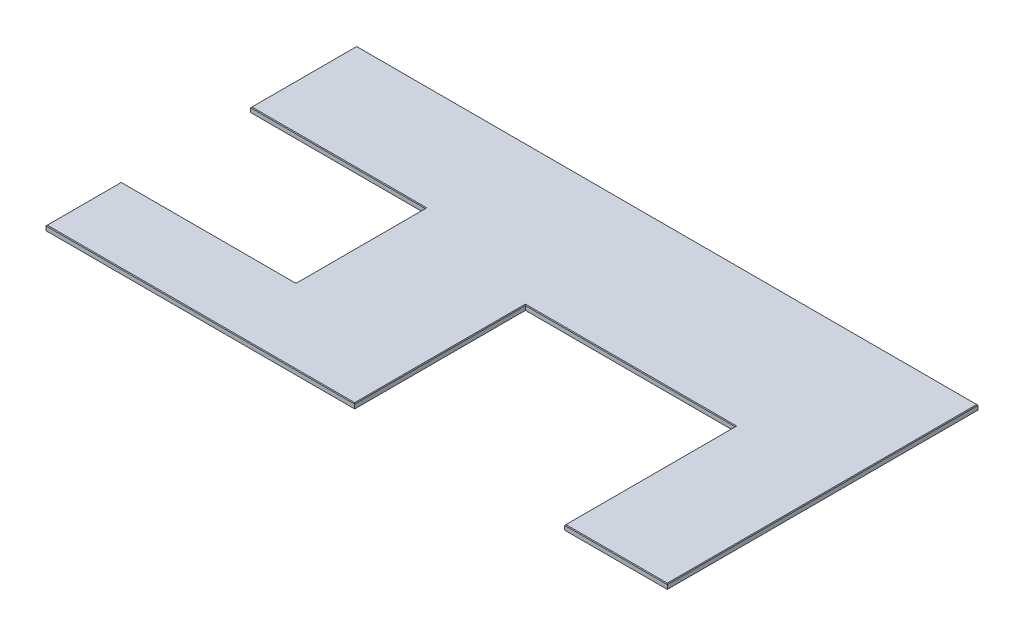
ISO-10303-21;
HEADER;
FILE_DESCRIPTION(('STEP AP214'),'2;1');
FILE_NAME('part.step','',(''),(''),'','','');
FILE_SCHEMA(('AUTOMOTIVE_DESIGN { 1 0 10303 214 1 1 1 1 }'));
ENDSEC;
DATA;
#1=APPLICATION_CONTEXT('core data for automotive mechanical design processes');
#2=APPLICATION_PROTOCOL_DEFINITION('international standard','automotive_design',2000,#1);
#3=PRODUCT_CONTEXT('',#1,'mechanical');
#4=PRODUCT('Part','Part','',(#3));
#5=PRODUCT_RELATED_PRODUCT_CATEGORY('part','',(#4));
#6=PRODUCT_DEFINITION_FORMATION('','',#4);
#7=PRODUCT_DEFINITION_CONTEXT('part definition',#1,'design');
#8=PRODUCT_DEFINITION('design','',#6,#7);
#9=PRODUCT_DEFINITION_SHAPE('','',#8);
#10=(LENGTH_UNIT() NAMED_UNIT(*) SI_UNIT(.MILLI.,.METRE.));
#11=(NAMED_UNIT(*) PLANE_ANGLE_UNIT() SI_UNIT($,.RADIAN.));
#12=(NAMED_UNIT(*) SI_UNIT($,.STERADIAN.) SOLID_ANGLE_UNIT());
#13=UNCERTAINTY_MEASURE_WITH_UNIT(LENGTH_MEASURE(1.E-05),#10,'distance_accuracy_value','');
#14=(GEOMETRIC_REPRESENTATION_CONTEXT(3) GLOBAL_UNCERTAINTY_ASSIGNED_CONTEXT((#13)) GLOBAL_UNIT_ASSIGNED_CONTEXT((#10,
#11,#12)) REPRESENTATION_CONTEXT('',''));
#15=CARTESIAN_POINT('',(0.,0.,0.));
#16=DIRECTION('',(0.,0.,1.));
#17=DIRECTION('',(1.,0.,0.));
#18=AXIS2_PLACEMENT_3D('',#15,#16,#17);
#19=CARTESIAN_POINT('',(0.,-19.05,0.));
#20=DIRECTION('',(0.,0.,1.));
#21=DIRECTION('',(1.,0.,0.));
#22=AXIS2_PLACEMENT_3D('',#19,#20,#21);
#23=PLANE('',#22);
#24=DIRECTION('',(0.,1.,0.));
#25=VECTOR('',#24,1.);
#26=CARTESIAN_POINT('',(1211.5165,-19.05,0.));
#27=LINE('',#26,#25);
#28=CARTESIAN_POINT('',(1211.5165,-19.05,0.));
#29=VERTEX_POINT('',#28);
#30=CARTESIAN_POINT('',(1211.5165,-2.53999999999999,0.));
#31=VERTEX_POINT('',#30);
#32=EDGE_CURVE('E165',#29,#31,#27,.T.);
#33=ORIENTED_EDGE('',*,*,#32,.T.);
#34=DIRECTION('',(-1.,0.,0.));
#35=VECTOR('',#34,1.);
#36=CARTESIAN_POINT('',(0.,-2.53999999999999,0.));
#37=LINE('',#36,#35);
#38=CARTESIAN_POINT('',(0.,-2.53999999999999,0.));
#39=VERTEX_POINT('',#38);
#40=EDGE_CURVE('E11',#31,#39,#37,.T.);
#41=ORIENTED_EDGE('',*,*,#40,.T.);
#42=DIRECTION('',(0.,1.,0.));
#43=VECTOR('',#42,1.);
#44=CARTESIAN_POINT('',(0.,-19.05,0.));
#45=LINE('',#44,#43);
#46=CARTESIAN_POINT('',(0.,-19.05,0.));
#47=VERTEX_POINT('',#46);
#48=EDGE_CURVE('E187',#47,#39,#45,.T.);
#49=ORIENTED_EDGE('',*,*,#48,.F.);
#50=DIRECTION('',(1.,0.,0.));
#51=VECTOR('',#50,1.);
#52=CARTESIAN_POINT('',(0.,-19.05,0.));
#53=LINE('',#52,#51);
#54=EDGE_CURVE('E180',#47,#29,#53,.T.);
#55=ORIENTED_EDGE('',*,*,#54,.T.);
#56=EDGE_LOOP('',(#33,#41,#49,#55));
#57=FACE_BOUND('',#56,.T.);
#58=ADVANCED_FACE('F40',(#57),#23,.T.);
#59=CARTESIAN_POINT('',(1.13148179390222E-13,-19.05,-295.275));
#60=DIRECTION('',(-1.,0.,0.));
#61=DIRECTION('',(0.,0.,1.));
#62=AXIS2_PLACEMENT_3D('',#59,#60,#61);
#63=PLANE('',#62);
#64=ORIENTED_EDGE('',*,*,#48,.T.);
#65=DIRECTION('',(0.,0.,-1.));
#66=VECTOR('',#65,1.);
#67=CARTESIAN_POINT('',(1.13148179390222E-13,-2.53999999999999,-295.275));
#68=LINE('',#67,#66);
#69=CARTESIAN_POINT('',(1.13148179390222E-13,-2.53999999999999,-295.275));
#70=VERTEX_POINT('',#69);
#71=EDGE_CURVE('E271',#39,#70,#68,.T.);
#72=ORIENTED_EDGE('',*,*,#71,.T.);
#73=DIRECTION('',(0.,1.,0.));
#74=VECTOR('',#73,1.);
#75=CARTESIAN_POINT('',(1.13148179390222E-13,-19.05,-295.275));
#76=LINE('',#75,#74);
#77=CARTESIAN_POINT('',(1.13148179390222E-13,-19.05,-295.275));
#78=VERTEX_POINT('',#77);
#79=EDGE_CURVE('E220',#78,#70,#76,.T.);
#80=ORIENTED_EDGE('',*,*,#79,.F.);
#81=DIRECTION('',(0.,0.,1.));
#82=VECTOR('',#81,1.);
#83=CARTESIAN_POINT('',(1.13148179390222E-13,-19.05,-295.275));
#84=LINE('',#83,#82);
#85=EDGE_CURVE('E173',#78,#47,#84,.T.);
#86=ORIENTED_EDGE('',*,*,#85,.T.);
#87=EDGE_LOOP('',(#64,#72,#80,#86));
#88=FACE_BOUND('',#87,.T.);
#89=ADVANCED_FACE('F353',(#88),#63,.T.);
#90=CARTESIAN_POINT('',(1.13148179390222E-13,-19.05,-295.275));
#91=DIRECTION('',(0.,0.,-1.));
#92=DIRECTION('',(-1.,0.,0.));
#93=AXIS2_PLACEMENT_3D('',#90,#91,#92);
#94=PLANE('',#93);
#95=ORIENTED_EDGE('',*,*,#79,.T.);
#96=DIRECTION('',(1.,0.,0.));
#97=VECTOR('',#96,1.);
#98=CARTESIAN_POINT('',(1.13148179390222E-13,-2.53999999999999,-295.275));
#99=LINE('',#98,#97);
#100=CARTESIAN_POINT('',(685.8,-2.53999999999999,-295.275));
#101=VERTEX_POINT('',#100);
#102=EDGE_CURVE('E274',#70,#101,#99,.T.);
#103=ORIENTED_EDGE('',*,*,#102,.T.);
#104=DIRECTION('',(0.,1.,0.));
#105=VECTOR('',#104,1.);
#106=CARTESIAN_POINT('',(685.8,-19.05,-295.275));
#107=LINE('',#106,#105);
#108=CARTESIAN_POINT('',(685.8,-19.05,-295.275));
#109=VERTEX_POINT('',#108);
#110=EDGE_CURVE('E223',#109,#101,#107,.T.);
#111=ORIENTED_EDGE('',*,*,#110,.F.);
#112=DIRECTION('',(-1.,0.,0.));
#113=VECTOR('',#112,1.);
#114=CARTESIAN_POINT('',(1.13148179390222E-13,-19.05,-295.275));
#115=LINE('',#114,#113);
#116=EDGE_CURVE('E214',#109,#78,#115,.T.);
#117=ORIENTED_EDGE('',*,*,#116,.T.);
#118=EDGE_LOOP('',(#95,#103,#111,#117));
#119=FACE_BOUND('',#118,.T.);
#120=ADVANCED_FACE('F364',(#119),#94,.T.);
#121=CARTESIAN_POINT('',(685.8,-19.05,-803.275));
#122=DIRECTION('',(-1.,0.,0.));
#123=DIRECTION('',(0.,0.,1.));
#124=AXIS2_PLACEMENT_3D('',#121,#122,#123);
#125=PLANE('',#124);
#126=ORIENTED_EDGE('',*,*,#110,.T.);
#127=DIRECTION('',(0.,0.,-1.));
#128=VECTOR('',#127,1.);
#129=CARTESIAN_POINT('',(685.8,-2.53999999999999,-803.275));
#130=LINE('',#129,#128);
#131=CARTESIAN_POINT('',(685.8,-2.53999999999999,-803.275));
#132=VERTEX_POINT('',#131);
#133=EDGE_CURVE('E276',#101,#132,#130,.T.);
#134=ORIENTED_EDGE('',*,*,#133,.T.);
#135=DIRECTION('',(0.,1.,0.));
#136=VECTOR('',#135,1.);
#137=CARTESIAN_POINT('',(685.8,-19.05,-803.275));
#138=LINE('',#137,#136);
#139=CARTESIAN_POINT('',(685.8,-19.05,-803.275));
#140=VERTEX_POINT('',#139);
#141=EDGE_CURVE('E226',#140,#132,#138,.T.);
#142=ORIENTED_EDGE('',*,*,#141,.F.);
#143=DIRECTION('',(0.,0.,1.));
#144=VECTOR('',#143,1.);
#145=CARTESIAN_POINT('',(685.8,-19.05,-803.275));
#146=LINE('',#145,#144);
#147=EDGE_CURVE('E211',#140,#109,#146,.T.);
#148=ORIENTED_EDGE('',*,*,#147,.T.);
#149=EDGE_LOOP('',(#126,#134,#142,#148));
#150=FACE_BOUND('',#149,.T.);
#151=ADVANCED_FACE('F368',(#150),#125,.T.);
#152=CARTESIAN_POINT('',(0.,-19.05,-803.275));
#153=DIRECTION('',(0.,0.,1.));
#154=DIRECTION('',(1.,0.,0.));
#155=AXIS2_PLACEMENT_3D('',#152,#153,#154);
#156=PLANE('',#155);
#157=ORIENTED_EDGE('',*,*,#141,.T.);
#158=DIRECTION('',(-1.,0.,0.));
#159=VECTOR('',#158,1.);
#160=CARTESIAN_POINT('',(0.,-2.53999999999999,-803.275));
#161=LINE('',#160,#159);
#162=CARTESIAN_POINT('',(0.,-2.53999999999999,-803.275));
#163=VERTEX_POINT('',#162);
#164=EDGE_CURVE('E278',#132,#163,#161,.T.);
#165=ORIENTED_EDGE('',*,*,#164,.T.);
#166=DIRECTION('',(0.,1.,0.));
#167=VECTOR('',#166,1.);
#168=CARTESIAN_POINT('',(0.,-19.05,-803.275));
#169=LINE('',#168,#167);
#170=CARTESIAN_POINT('',(0.,-19.05,-803.275));
#171=VERTEX_POINT('',#170);
#172=EDGE_CURVE('E229',#171,#163,#169,.T.);
#173=ORIENTED_EDGE('',*,*,#172,.F.);
#174=DIRECTION('',(1.,0.,0.));
#175=VECTOR('',#174,1.);
#176=CARTESIAN_POINT('',(0.,-19.05,-803.275));
#177=LINE('',#176,#175);
#178=EDGE_CURVE('E208',#171,#140,#177,.T.);
#179=ORIENTED_EDGE('',*,*,#178,.T.);
#180=EDGE_LOOP('',(#157,#165,#173,#179));
#181=FACE_BOUND('',#180,.T.);
#182=ADVANCED_FACE('F380',(#181),#156,.T.);
#183=CARTESIAN_POINT('',(-2.29534139493609E-13,-19.05,-1219.2));
#184=DIRECTION('',(-1.,0.,0.));
#185=DIRECTION('',(0.,0.,1.));
#186=AXIS2_PLACEMENT_3D('',#183,#184,#185);
#187=PLANE('',#186);
#188=ORIENTED_EDGE('',*,*,#172,.T.);
#189=DIRECTION('',(0.,0.,-1.));
#190=VECTOR('',#189,1.);
#191=CARTESIAN_POINT('',(-2.29534139493609E-13,-2.53999999999999,-1219.2));
#192=LINE('',#191,#190);
#193=CARTESIAN_POINT('',(-2.29534139493609E-13,-2.53999999999999,-1219.2));
#194=VERTEX_POINT('',#193);
#195=EDGE_CURVE('E280',#163,#194,#192,.T.);
#196=ORIENTED_EDGE('',*,*,#195,.T.);
#197=DIRECTION('',(0.,1.,0.));
#198=VECTOR('',#197,1.);
#199=CARTESIAN_POINT('',(-2.29534139493609E-13,-19.05,-1219.2));
#200=LINE('',#199,#198);
#201=CARTESIAN_POINT('',(-2.29534139493609E-13,-19.05,-1219.2));
#202=VERTEX_POINT('',#201);
#203=EDGE_CURVE('E232',#202,#194,#200,.T.);
#204=ORIENTED_EDGE('',*,*,#203,.F.);
#205=DIRECTION('',(0.,0.,1.));
#206=VECTOR('',#205,1.);
#207=CARTESIAN_POINT('',(-2.29534139493609E-13,-19.05,-1219.2));
#208=LINE('',#207,#206);
#209=EDGE_CURVE('E205',#202,#171,#208,.T.);
#210=ORIENTED_EDGE('',*,*,#209,.T.);
#211=EDGE_LOOP('',(#188,#196,#204,#210));
#212=FACE_BOUND('',#211,.T.);
#213=ADVANCED_FACE('F384',(#212),#187,.T.);
#214=CARTESIAN_POINT('',(2438.4,-19.05,-1219.2));
#215=DIRECTION('',(0.,0.,-1.));
#216=DIRECTION('',(-1.,0.,0.));
#217=AXIS2_PLACEMENT_3D('',#214,#215,#216);
#218=PLANE('',#217);
#219=ORIENTED_EDGE('',*,*,#203,.T.);
#220=DIRECTION('',(1.,0.,0.));
#221=VECTOR('',#220,1.);
#222=CARTESIAN_POINT('',(2438.4,-2.53999999999999,-1219.2));
#223=LINE('',#222,#221);
#224=CARTESIAN_POINT('',(2438.4,-2.53999999999999,-1219.2));
#225=VERTEX_POINT('',#224);
#226=EDGE_CURVE('E282',#194,#225,#223,.T.);
#227=ORIENTED_EDGE('',*,*,#226,.T.);
#228=DIRECTION('',(0.,1.,0.));
#229=VECTOR('',#228,1.);
#230=CARTESIAN_POINT('',(2438.4,-19.05,-1219.2));
#231=LINE('',#230,#229);
#232=CARTESIAN_POINT('',(2438.4,-19.05,-1219.2));
#233=VERTEX_POINT('',#232);
#234=EDGE_CURVE('E235',#233,#225,#231,.T.);
#235=ORIENTED_EDGE('',*,*,#234,.F.);
#236=DIRECTION('',(-1.,0.,0.));
#237=VECTOR('',#236,1.);
#238=CARTESIAN_POINT('',(2438.4,-19.05,-1219.2));
#239=LINE('',#238,#237);
#240=EDGE_CURVE('E202',#233,#202,#239,.T.);
#241=ORIENTED_EDGE('',*,*,#240,.T.);
#242=EDGE_LOOP('',(#219,#227,#235,#241));
#243=FACE_BOUND('',#242,.T.);
#244=ADVANCED_FACE('F393',(#243),#218,.T.);
#245=CARTESIAN_POINT('',(2438.4,-19.05,0.));
#246=DIRECTION('',(1.,0.,0.));
#247=DIRECTION('',(0.,0.,-1.));
#248=AXIS2_PLACEMENT_3D('',#245,#246,#247);
#249=PLANE('',#248);
#250=ORIENTED_EDGE('',*,*,#234,.T.);
#251=DIRECTION('',(0.,0.,1.));
#252=VECTOR('',#251,1.);
#253=CARTESIAN_POINT('',(2438.4,-2.53999999999999,0.));
#254=LINE('',#253,#252);
#255=CARTESIAN_POINT('',(2438.4,-2.53999999999999,0.));
#256=VERTEX_POINT('',#255);
#257=EDGE_CURVE('E284',#225,#256,#254,.T.);
#258=ORIENTED_EDGE('',*,*,#257,.T.);
#259=DIRECTION('',(0.,1.,0.));
#260=VECTOR('',#259,1.);
#261=CARTESIAN_POINT('',(2438.4,-19.05,0.));
#262=LINE('',#261,#260);
#263=CARTESIAN_POINT('',(2438.4,-19.05,0.));
#264=VERTEX_POINT('',#263);
#265=EDGE_CURVE('E238',#264,#256,#262,.T.);
#266=ORIENTED_EDGE('',*,*,#265,.F.);
#267=DIRECTION('',(0.,0.,-1.));
#268=VECTOR('',#267,1.);
#269=CARTESIAN_POINT('',(2438.4,-19.05,0.));
#270=LINE('',#269,#268);
#271=EDGE_CURVE('E199',#264,#233,#270,.T.);
#272=ORIENTED_EDGE('',*,*,#271,.T.);
#273=EDGE_LOOP('',(#250,#258,#266,#272));
#274=FACE_BOUND('',#273,.T.);
#275=ADVANCED_FACE('F396',(#274),#249,.T.);
#276=CARTESIAN_POINT('',(2035.429,-19.05,0.));
#277=DIRECTION('',(0.,0.,1.));
#278=DIRECTION('',(1.,0.,0.));
#279=AXIS2_PLACEMENT_3D('',#276,#277,#278);
#280=PLANE('',#279);
#281=ORIENTED_EDGE('',*,*,#265,.T.);
#282=DIRECTION('',(-1.,0.,0.));
#283=VECTOR('',#282,1.);
#284=CARTESIAN_POINT('',(2035.429,-2.53999999999999,0.));
#285=LINE('',#284,#283);
#286=CARTESIAN_POINT('',(2035.429,-2.53999999999999,0.));
#287=VERTEX_POINT('',#286);
#288=EDGE_CURVE('E286',#256,#287,#285,.T.);
#289=ORIENTED_EDGE('',*,*,#288,.T.);
#290=DIRECTION('',(0.,1.,0.));
#291=VECTOR('',#290,1.);
#292=CARTESIAN_POINT('',(2035.429,-19.05,0.));
#293=LINE('',#292,#291);
#294=CARTESIAN_POINT('',(2035.429,-19.05,0.));
#295=VERTEX_POINT('',#294);
#296=EDGE_CURVE('E241',#295,#287,#293,.T.);
#297=ORIENTED_EDGE('',*,*,#296,.F.);
#298=DIRECTION('',(1.,0.,0.));
#299=VECTOR('',#298,1.);
#300=CARTESIAN_POINT('',(2035.429,-19.05,0.));
#301=LINE('',#300,#299);
#302=EDGE_CURVE('E196',#295,#264,#301,.T.);
#303=ORIENTED_EDGE('',*,*,#302,.T.);
#304=EDGE_LOOP('',(#281,#289,#297,#303));
#305=FACE_BOUND('',#304,.T.);
#306=ADVANCED_FACE('F400',(#305),#280,.T.);
#307=CARTESIAN_POINT('',(2035.429,-19.05,-669.925));
#308=DIRECTION('',(-1.,0.,0.));
#309=DIRECTION('',(0.,0.,1.));
#310=AXIS2_PLACEMENT_3D('',#307,#308,#309);
#311=PLANE('',#310);
#312=ORIENTED_EDGE('',*,*,#296,.T.);
#313=DIRECTION('',(0.,0.,-1.));
#314=VECTOR('',#313,1.);
#315=CARTESIAN_POINT('',(2035.429,-2.53999999999999,-669.925));
#316=LINE('',#315,#314);
#317=CARTESIAN_POINT('',(2035.429,-2.53999999999999,-669.925));
#318=VERTEX_POINT('',#317);
#319=EDGE_CURVE('E288',#287,#318,#316,.T.);
#320=ORIENTED_EDGE('',*,*,#319,.T.);
#321=DIRECTION('',(0.,1.,0.));
#322=VECTOR('',#321,1.);
#323=CARTESIAN_POINT('',(2035.429,-19.05,-669.925));
#324=LINE('',#323,#322);
#325=CARTESIAN_POINT('',(2035.429,-19.05,-669.925));
#326=VERTEX_POINT('',#325);
#327=EDGE_CURVE('E244',#326,#318,#324,.T.);
#328=ORIENTED_EDGE('',*,*,#327,.F.);
#329=DIRECTION('',(0.,0.,1.));
#330=VECTOR('',#329,1.);
#331=CARTESIAN_POINT('',(2035.429,-19.05,-669.925));
#332=LINE('',#331,#330);
#333=EDGE_CURVE('E193',#326,#295,#332,.T.);
#334=ORIENTED_EDGE('',*,*,#333,.T.);
#335=EDGE_LOOP('',(#312,#320,#328,#334));
#336=FACE_BOUND('',#335,.T.);
#337=ADVANCED_FACE('F402',(#336),#311,.T.);
#338=CARTESIAN_POINT('',(1211.5165,-19.05,-669.925));
#339=DIRECTION('',(0.,0.,1.));
#340=DIRECTION('',(1.,0.,0.));
#341=AXIS2_PLACEMENT_3D('',#338,#339,#340);
#342=PLANE('',#341);
#343=ORIENTED_EDGE('',*,*,#327,.T.);
#344=DIRECTION('',(-1.,0.,0.));
#345=VECTOR('',#344,1.);
#346=CARTESIAN_POINT('',(1211.5165,-2.53999999999999,-669.925));
#347=LINE('',#346,#345);
#348=CARTESIAN_POINT('',(1211.5165,-2.53999999999999,-669.925));
#349=VERTEX_POINT('',#348);
#350=EDGE_CURVE('E65',#318,#349,#347,.T.);
#351=ORIENTED_EDGE('',*,*,#350,.T.);
#352=DIRECTION('',(0.,1.,0.));
#353=VECTOR('',#352,1.);
#354=CARTESIAN_POINT('',(1211.5165,-19.05,-669.925));
#355=LINE('',#354,#353);
#356=CARTESIAN_POINT('',(1211.5165,-19.05,-669.925));
#357=VERTEX_POINT('',#356);
#358=EDGE_CURVE('E172',#357,#349,#355,.T.);
#359=ORIENTED_EDGE('',*,*,#358,.F.);
#360=DIRECTION('',(1.,0.,0.));
#361=VECTOR('',#360,1.);
#362=CARTESIAN_POINT('',(1211.5165,-19.05,-669.925));
#363=LINE('',#362,#361);
#364=EDGE_CURVE('E184',#357,#326,#363,.T.);
#365=ORIENTED_EDGE('',*,*,#364,.T.);
#366=EDGE_LOOP('',(#343,#351,#359,#365));
#367=FACE_BOUND('',#366,.T.);
#368=ADVANCED_FACE('F403',(#367),#342,.T.);
#369=CARTESIAN_POINT('',(1211.5165,-19.05,0.));
#370=DIRECTION('',(1.,0.,0.));
#371=DIRECTION('',(0.,0.,-1.));
#372=AXIS2_PLACEMENT_3D('',#369,#370,#371);
#373=PLANE('',#372);
#374=ORIENTED_EDGE('',*,*,#358,.T.);
#375=DIRECTION('',(0.,0.,1.));
#376=VECTOR('',#375,1.);
#377=CARTESIAN_POINT('',(1211.5165,-2.53999999999999,0.));
#378=LINE('',#377,#376);
#379=EDGE_CURVE('E50',#349,#31,#378,.T.);
#380=ORIENTED_EDGE('',*,*,#379,.T.);
#381=ORIENTED_EDGE('',*,*,#32,.F.);
#382=DIRECTION('',(0.,0.,-1.));
#383=VECTOR('',#382,1.);
#384=CARTESIAN_POINT('',(1211.5165,-19.05,0.));
#385=LINE('',#384,#383);
#386=EDGE_CURVE('E168',#29,#357,#385,.T.);
#387=ORIENTED_EDGE('',*,*,#386,.T.);
#388=EDGE_LOOP('',(#374,#380,#381,#387));
#389=FACE_BOUND('',#388,.T.);
#390=ADVANCED_FACE('F167',(#389),#373,.T.);
#391=CARTESIAN_POINT('',(0.,-19.05,0.));
#392=DIRECTION('',(0.,1.,0.));
#393=DIRECTION('',(0.,0.,1.));
#394=AXIS2_PLACEMENT_3D('',#391,#392,#393);
#395=PLANE('',#394);
#396=ORIENTED_EDGE('',*,*,#54,.F.);
#397=ORIENTED_EDGE('',*,*,#85,.F.);
#398=ORIENTED_EDGE('',*,*,#116,.F.);
#399=ORIENTED_EDGE('',*,*,#147,.F.);
#400=ORIENTED_EDGE('',*,*,#178,.F.);
#401=ORIENTED_EDGE('',*,*,#209,.F.);
#402=ORIENTED_EDGE('',*,*,#240,.F.);
#403=ORIENTED_EDGE('',*,*,#271,.F.);
#404=ORIENTED_EDGE('',*,*,#302,.F.);
#405=ORIENTED_EDGE('',*,*,#333,.F.);
#406=ORIENTED_EDGE('',*,*,#364,.F.);
#407=ORIENTED_EDGE('',*,*,#386,.F.);
#408=EDGE_LOOP('',(#396,#397,#398,#399,#400,#401,#402,#403,#404,#405,#406,#407));
#409=FACE_BOUND('',#408,.T.);
#410=ADVANCED_FACE('F178',(#409),#395,.F.);
#411=CARTESIAN_POINT('',(0.,0.,0.));
#412=DIRECTION('',(0.,1.,0.));
#413=DIRECTION('',(0.,0.,1.));
#414=AXIS2_PLACEMENT_3D('',#411,#412,#413);
#415=PLANE('',#414);
#416=DIRECTION('',(-1.,0.,0.));
#417=VECTOR('',#416,1.);
#418=CARTESIAN_POINT('',(0.,0.,-292.735));
#419=LINE('',#418,#417);
#420=CARTESIAN_POINT('',(688.34,0.,-292.735));
#421=VERTEX_POINT('',#420);
#422=CARTESIAN_POINT('',(2.5400000000001,0.,-292.735));
#423=VERTEX_POINT('',#422);
#424=EDGE_CURVE('E266',#421,#423,#419,.T.);
#425=ORIENTED_EDGE('',*,*,#424,.T.);
#426=DIRECTION('',(0.,0.,1.));
#427=VECTOR('',#426,1.);
#428=CARTESIAN_POINT('',(2.53999999999999,0.,0.));
#429=LINE('',#428,#427);
#430=CARTESIAN_POINT('',(2.53999999999999,0.,-2.53999999999999));
#431=VERTEX_POINT('',#430);
#432=EDGE_CURVE('E268',#423,#431,#429,.T.);
#433=ORIENTED_EDGE('',*,*,#432,.T.);
#434=DIRECTION('',(1.,0.,0.));
#435=VECTOR('',#434,1.);
#436=CARTESIAN_POINT('',(0.,0.,-2.53999999999999));
#437=LINE('',#436,#435);
#438=CARTESIAN_POINT('',(1208.9765,0.,-2.53999999999999));
#439=VERTEX_POINT('',#438);
#440=EDGE_CURVE('E219',#431,#439,#437,.T.);
#441=ORIENTED_EDGE('',*,*,#440,.T.);
#442=DIRECTION('',(0.,0.,-1.));
#443=VECTOR('',#442,1.);
#444=CARTESIAN_POINT('',(1208.9765,0.,0.));
#445=LINE('',#444,#443);
#446=CARTESIAN_POINT('',(1208.9765,0.,-672.465));
#447=VERTEX_POINT('',#446);
#448=EDGE_CURVE('E248',#439,#447,#445,.T.);
#449=ORIENTED_EDGE('',*,*,#448,.T.);
#450=DIRECTION('',(1.,0.,0.));
#451=VECTOR('',#450,1.);
#452=CARTESIAN_POINT('',(0.,0.,-672.465));
#453=LINE('',#452,#451);
#454=CARTESIAN_POINT('',(2037.969,0.,-672.465));
#455=VERTEX_POINT('',#454);
#456=EDGE_CURVE('E250',#447,#455,#453,.T.);
#457=ORIENTED_EDGE('',*,*,#456,.T.);
#458=DIRECTION('',(0.,0.,1.));
#459=VECTOR('',#458,1.);
#460=CARTESIAN_POINT('',(2037.969,0.,0.));
#461=LINE('',#460,#459);
#462=CARTESIAN_POINT('',(2037.969,0.,-2.53999999999999));
#463=VERTEX_POINT('',#462);
#464=EDGE_CURVE('E252',#455,#463,#461,.T.);
#465=ORIENTED_EDGE('',*,*,#464,.T.);
#466=DIRECTION('',(1.,0.,0.));
#467=VECTOR('',#466,1.);
#468=CARTESIAN_POINT('',(0.,0.,-2.53999999999999));
#469=LINE('',#468,#467);
#470=CARTESIAN_POINT('',(2435.86,0.,-2.53999999999999));
#471=VERTEX_POINT('',#470);
#472=EDGE_CURVE('E254',#463,#471,#469,.T.);
#473=ORIENTED_EDGE('',*,*,#472,.T.);
#474=DIRECTION('',(0.,0.,-1.));
#475=VECTOR('',#474,1.);
#476=CARTESIAN_POINT('',(2435.86,0.,0.));
#477=LINE('',#476,#475);
#478=CARTESIAN_POINT('',(2435.86,0.,-1216.66));
#479=VERTEX_POINT('',#478);
#480=EDGE_CURVE('E256',#471,#479,#477,.T.);
#481=ORIENTED_EDGE('',*,*,#480,.T.);
#482=DIRECTION('',(-1.,0.,0.));
#483=VECTOR('',#482,1.);
#484=CARTESIAN_POINT('',(0.,0.,-1216.66));
#485=LINE('',#484,#483);
#486=CARTESIAN_POINT('',(2.53999999999976,0.,-1216.66));
#487=VERTEX_POINT('',#486);
#488=EDGE_CURVE('E258',#479,#487,#485,.T.);
#489=ORIENTED_EDGE('',*,*,#488,.T.);
#490=DIRECTION('',(0.,0.,1.));
#491=VECTOR('',#490,1.);
#492=CARTESIAN_POINT('',(2.54000000000058,0.,0.));
#493=LINE('',#492,#491);
#494=CARTESIAN_POINT('',(2.54000000000004,0.,-805.815));
#495=VERTEX_POINT('',#494);
#496=EDGE_CURVE('E260',#487,#495,#493,.T.);
#497=ORIENTED_EDGE('',*,*,#496,.T.);
#498=DIRECTION('',(1.,0.,0.));
#499=VECTOR('',#498,1.);
#500=CARTESIAN_POINT('',(0.,0.,-805.815));
#501=LINE('',#500,#499);
#502=CARTESIAN_POINT('',(688.34,0.,-805.815));
#503=VERTEX_POINT('',#502);
#504=EDGE_CURVE('E262',#495,#503,#501,.T.);
#505=ORIENTED_EDGE('',*,*,#504,.T.);
#506=DIRECTION('',(0.,0.,1.));
#507=VECTOR('',#506,1.);
#508=CARTESIAN_POINT('',(688.34,0.,-1.50435219836709E-13));
#509=LINE('',#508,#507);
#510=EDGE_CURVE('E264',#503,#421,#509,.T.);
#511=ORIENTED_EDGE('',*,*,#510,.T.);
#512=EDGE_LOOP('',(#425,#433,#441,#449,#457,#465,#473,#481,#489,#497,#505,#511));
#513=FACE_BOUND('',#512,.T.);
#514=ADVANCED_FACE('F332',(#513),#415,.T.);
#515=CARTESIAN_POINT('',(2435.86,0.,0.));
#516=DIRECTION('',(-0.707106781186578,-0.707106781186517,0.));
#517=DIRECTION('',(0.,0.,-1.));
#518=AXIS2_PLACEMENT_3D('',#515,#516,#517);
#519=PLANE('',#518);
#520=DIRECTION('',(-0.577350269189592,0.577350269189642,-0.577350269189642));
#521=VECTOR('',#520,1.);
#522=CARTESIAN_POINT('',(1623.90666666676,811.95333333331,-814.49333333331));
#523=LINE('',#522,#521);
#524=EDGE_CURVE('E190',#256,#471,#523,.T.);
#525=ORIENTED_EDGE('',*,*,#524,.F.);
#526=ORIENTED_EDGE('',*,*,#257,.F.);
#527=DIRECTION('',(-0.577350269189592,0.577350269189642,0.577350269189642));
#528=VECTOR('',#527,1.);
#529=CARTESIAN_POINT('',(2030.30666666668,405.553333333357,-811.106666666643));
#530=LINE('',#529,#528);
#531=EDGE_CURVE('E45',#479,#225,#530,.F.);
#532=ORIENTED_EDGE('',*,*,#531,.F.);
#533=ORIENTED_EDGE('',*,*,#480,.F.);
#534=EDGE_LOOP('',(#525,#526,#532,#533));
#535=FACE_BOUND('',#534,.T.);
#536=ADVANCED_FACE('F43',(#535),#519,.F.);
#537=CARTESIAN_POINT('',(0.,0.,-1216.66));
#538=DIRECTION('',(0.,-0.707106781186548,0.707106781186548));
#539=DIRECTION('',(-1.,0.,0.));
#540=AXIS2_PLACEMENT_3D('',#537,#538,#539);
#541=PLANE('',#540);
#542=ORIENTED_EDGE('',*,*,#531,.T.);
#543=ORIENTED_EDGE('',*,*,#226,.F.);
#544=DIRECTION('',(0.577350269189626,0.577350269189626,0.577350269189626));
#545=VECTOR('',#544,1.);
#546=CARTESIAN_POINT('',(1.69333333333317,-0.846666666666586,-1217.50666666667));
#547=LINE('',#546,#545);
#548=EDGE_CURVE('E317',#487,#194,#547,.F.);
#549=ORIENTED_EDGE('',*,*,#548,.F.);
#550=ORIENTED_EDGE('',*,*,#488,.F.);
#551=EDGE_LOOP('',(#542,#543,#549,#550));
#552=FACE_BOUND('',#551,.T.);
#553=ADVANCED_FACE('F391',(#552),#541,.F.);
#554=CARTESIAN_POINT('',(0.,0.,-2.53999999999999));
#555=DIRECTION('',(0.,-0.707106781186548,-0.707106781186548));
#556=DIRECTION('',(1.,0.,0.));
#557=AXIS2_PLACEMENT_3D('',#554,#555,#556);
#558=PLANE('',#557);
#559=ORIENTED_EDGE('',*,*,#524,.T.);
#560=ORIENTED_EDGE('',*,*,#472,.F.);
#561=DIRECTION('',(0.577350269189592,0.577350269189642,-0.577350269189642));
#562=VECTOR('',#561,1.);
#563=CARTESIAN_POINT('',(2037.12233333333,-0.846666666666711,-1.69333333333327));
#564=LINE('',#563,#562);
#565=EDGE_CURVE('E314',#287,#463,#564,.T.);
#566=ORIENTED_EDGE('',*,*,#565,.F.);
#567=ORIENTED_EDGE('',*,*,#288,.F.);
#568=EDGE_LOOP('',(#559,#560,#566,#567));
#569=FACE_BOUND('',#568,.T.);
#570=ADVANCED_FACE('F324',(#569),#558,.F.);
#571=CARTESIAN_POINT('',(2.54000000000058,0.,0.));
#572=DIRECTION('',(0.707106781186548,-0.707106781186548,0.));
#573=DIRECTION('',(0.,0.,1.));
#574=AXIS2_PLACEMENT_3D('',#571,#572,#573);
#575=PLANE('',#574);
#576=ORIENTED_EDGE('',*,*,#548,.T.);
#577=ORIENTED_EDGE('',*,*,#195,.F.);
#578=DIRECTION('',(0.577350269189626,0.577350269189626,-0.577350269189626));
#579=VECTOR('',#578,1.);
#580=CARTESIAN_POINT('',(-266.065,-268.605,-537.21));
#581=LINE('',#580,#579);
#582=EDGE_CURVE('E311',#495,#163,#581,.F.);
#583=ORIENTED_EDGE('',*,*,#582,.F.);
#584=ORIENTED_EDGE('',*,*,#496,.F.);
#585=EDGE_LOOP('',(#576,#577,#583,#584));
#586=FACE_BOUND('',#585,.T.);
#587=ADVANCED_FACE('F387',(#586),#575,.F.);
#588=CARTESIAN_POINT('',(2037.969,0.,0.));
#589=DIRECTION('',(0.707106781186578,-0.707106781186517,0.));
#590=DIRECTION('',(0.,0.,1.));
#591=AXIS2_PLACEMENT_3D('',#588,#589,#590);
#592=PLANE('',#591);
#593=ORIENTED_EDGE('',*,*,#565,.T.);
#594=ORIENTED_EDGE('',*,*,#464,.F.);
#595=DIRECTION('',(0.577350269189592,0.577350269189642,-0.577350269189642));
#596=VECTOR('',#595,1.);
#597=CARTESIAN_POINT('',(1813.81400000001,-224.155000000013,-448.309999999987));
#598=LINE('',#597,#596);
#599=EDGE_CURVE('E308',#318,#455,#598,.T.);
#600=ORIENTED_EDGE('',*,*,#599,.F.);
#601=ORIENTED_EDGE('',*,*,#319,.F.);
#602=EDGE_LOOP('',(#593,#594,#600,#601));
#603=FACE_BOUND('',#602,.T.);
#604=ADVANCED_FACE('F338',(#603),#592,.F.);
#605=CARTESIAN_POINT('',(0.,0.,-805.815));
#606=DIRECTION('',(0.,-0.707106781186548,-0.707106781186548));
#607=DIRECTION('',(1.,0.,0.));
#608=AXIS2_PLACEMENT_3D('',#605,#606,#607);
#609=PLANE('',#608);
#610=ORIENTED_EDGE('',*,*,#582,.T.);
#611=ORIENTED_EDGE('',*,*,#164,.F.);
#612=DIRECTION('',(0.577350269189633,0.577350269189622,-0.577350269189622));
#613=VECTOR('',#612,1.);
#614=CARTESIAN_POINT('',(419.734999999999,-268.604999999997,-537.210000000003));
#615=LINE('',#614,#613);
#616=EDGE_CURVE('E305',#503,#132,#615,.F.);
#617=ORIENTED_EDGE('',*,*,#616,.F.);
#618=ORIENTED_EDGE('',*,*,#504,.F.);
#619=EDGE_LOOP('',(#610,#611,#617,#618));
#620=FACE_BOUND('',#619,.T.);
#621=ADVANCED_FACE('F377',(#620),#609,.F.);
#622=CARTESIAN_POINT('',(0.,0.,-672.465));
#623=DIRECTION('',(0.,-0.707106781186548,-0.707106781186548));
#624=DIRECTION('',(1.,0.,0.));
#625=AXIS2_PLACEMENT_3D('',#622,#623,#624);
#626=PLANE('',#625);
#627=ORIENTED_EDGE('',*,*,#599,.T.);
#628=ORIENTED_EDGE('',*,*,#456,.F.);
#629=DIRECTION('',(-0.577350269189626,0.577350269189626,-0.577350269189626));
#630=VECTOR('',#629,1.);
#631=CARTESIAN_POINT('',(805.984333333333,402.992166666667,-1075.45716666667));
#632=LINE('',#631,#630);
#633=EDGE_CURVE('E302',#349,#447,#632,.T.);
#634=ORIENTED_EDGE('',*,*,#633,.F.);
#635=ORIENTED_EDGE('',*,*,#350,.F.);
#636=EDGE_LOOP('',(#627,#628,#634,#635));
#637=FACE_BOUND('',#636,.T.);
#638=ADVANCED_FACE('F341',(#637),#626,.F.);
#639=CARTESIAN_POINT('',(688.34,0.,-1.50435219836709E-13));
#640=DIRECTION('',(0.707106781186541,-0.707106781186554,0.));
#641=DIRECTION('',(0.,0.,1.));
#642=AXIS2_PLACEMENT_3D('',#639,#640,#641);
#643=PLANE('',#642);
#644=ORIENTED_EDGE('',*,*,#616,.T.);
#645=ORIENTED_EDGE('',*,*,#133,.F.);
#646=DIRECTION('',(0.577350269189633,0.577350269189622,0.577350269189622));
#647=VECTOR('',#646,1.);
#648=CARTESIAN_POINT('',(458.893333333328,-229.446666666668,-522.181666666668));
#649=LINE('',#648,#647);
#650=EDGE_CURVE('E299',#421,#101,#649,.F.);
#651=ORIENTED_EDGE('',*,*,#650,.F.);
#652=ORIENTED_EDGE('',*,*,#510,.F.);
#653=EDGE_LOOP('',(#644,#645,#651,#652));
#654=FACE_BOUND('',#653,.T.);
#655=ADVANCED_FACE('F371',(#654),#643,.F.);
#656=CARTESIAN_POINT('',(1208.9765,0.,0.));
#657=DIRECTION('',(-0.707106781186548,-0.707106781186548,0.));
#658=DIRECTION('',(0.,0.,-1.));
#659=AXIS2_PLACEMENT_3D('',#656,#657,#658);
#660=PLANE('',#659);
#661=ORIENTED_EDGE('',*,*,#633,.T.);
#662=ORIENTED_EDGE('',*,*,#448,.F.);
#663=DIRECTION('',(-0.577350269189626,0.577350269189626,-0.577350269189626));
#664=VECTOR('',#663,1.);
#665=CARTESIAN_POINT('',(805.984333333333,402.992166666667,-405.532166666667));
#666=LINE('',#665,#664);
#667=EDGE_CURVE('E296',#31,#439,#666,.T.);
#668=ORIENTED_EDGE('',*,*,#667,.F.);
#669=ORIENTED_EDGE('',*,*,#379,.F.);
#670=EDGE_LOOP('',(#661,#662,#668,#669));
#671=FACE_BOUND('',#670,.T.);
#672=ADVANCED_FACE('F345',(#671),#660,.F.);
#673=CARTESIAN_POINT('',(0.,0.,-292.735));
#674=DIRECTION('',(0.,-0.707106781186548,0.707106781186548));
#675=DIRECTION('',(-1.,0.,0.));
#676=AXIS2_PLACEMENT_3D('',#673,#674,#675);
#677=PLANE('',#676);
#678=ORIENTED_EDGE('',*,*,#650,.T.);
#679=ORIENTED_EDGE('',*,*,#102,.F.);
#680=DIRECTION('',(0.577350269189626,0.577350269189626,0.577350269189626));
#681=VECTOR('',#680,1.);
#682=CARTESIAN_POINT('',(1.69333333333341,-0.846666666666692,-293.581666666667));
#683=LINE('',#682,#681);
#684=EDGE_CURVE('E294',#423,#70,#683,.F.);
#685=ORIENTED_EDGE('',*,*,#684,.F.);
#686=ORIENTED_EDGE('',*,*,#424,.F.);
#687=EDGE_LOOP('',(#678,#679,#685,#686));
#688=FACE_BOUND('',#687,.T.);
#689=ADVANCED_FACE('F361',(#688),#677,.F.);
#690=CARTESIAN_POINT('',(0.,0.,-2.53999999999999));
#691=DIRECTION('',(0.,-0.707106781186548,-0.707106781186548));
#692=DIRECTION('',(1.,0.,0.));
#693=AXIS2_PLACEMENT_3D('',#690,#691,#692);
#694=PLANE('',#693);
#695=ORIENTED_EDGE('',*,*,#667,.T.);
#696=ORIENTED_EDGE('',*,*,#440,.F.);
#697=DIRECTION('',(-0.577350269189626,-0.577350269189626,0.577350269189626));
#698=VECTOR('',#697,1.);
#699=CARTESIAN_POINT('',(1.69333333333332,-0.846666666666663,-1.69333333333332));
#700=LINE('',#699,#698);
#701=EDGE_CURVE('E292',#39,#431,#700,.F.);
#702=ORIENTED_EDGE('',*,*,#701,.F.);
#703=ORIENTED_EDGE('',*,*,#40,.F.);
#704=EDGE_LOOP('',(#695,#696,#702,#703));
#705=FACE_BOUND('',#704,.T.);
#706=ADVANCED_FACE('F350',(#705),#694,.F.);
#707=CARTESIAN_POINT('',(2.53999999999999,0.,0.));
#708=DIRECTION('',(0.707106781186548,-0.707106781186548,0.));
#709=DIRECTION('',(0.,0.,1.));
#710=AXIS2_PLACEMENT_3D('',#707,#708,#709);
#711=PLANE('',#710);
#712=ORIENTED_EDGE('',*,*,#684,.T.);
#713=ORIENTED_EDGE('',*,*,#71,.F.);
#714=ORIENTED_EDGE('',*,*,#701,.T.);
#715=ORIENTED_EDGE('',*,*,#432,.F.);
#716=EDGE_LOOP('',(#712,#713,#714,#715));
#717=FACE_BOUND('',#716,.T.);
#718=ADVANCED_FACE('F355',(#717),#711,.F.);
#719=CLOSED_SHELL('',(#58,#89,#120,#151,#182,#213,#244,#275,#306,#337,#368,#390,#410,#514,#536,
#553,#570,#587,#604,#621,#638,#655,#672,#689,#706,#718));
#720=MANIFOLD_SOLID_BREP('B2',#719);
#721=ADVANCED_BREP_SHAPE_REPRESENTATION('',(#18,#720),#14);
#722=SHAPE_DEFINITION_REPRESENTATION(#9,#721);
ENDSEC;
END-ISO-10303-21;
